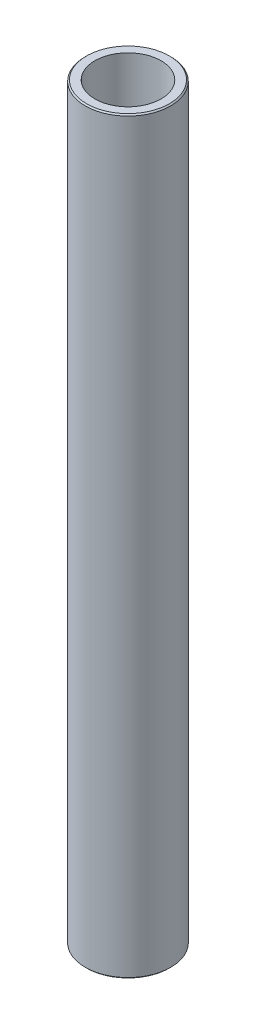
ISO-10303-21;
HEADER;
FILE_DESCRIPTION(('STEP AP214'),'2;1');
FILE_NAME('part.step','',(''),(''),'','','');
FILE_SCHEMA(('AUTOMOTIVE_DESIGN { 1 0 10303 214 1 1 1 1 }'));
ENDSEC;
DATA;
#1=APPLICATION_CONTEXT('core data for automotive mechanical design processes');
#2=APPLICATION_PROTOCOL_DEFINITION('international standard','automotive_design',2000,#1);
#3=PRODUCT_CONTEXT('',#1,'mechanical');
#4=PRODUCT('Part','Part','',(#3));
#5=PRODUCT_RELATED_PRODUCT_CATEGORY('part','',(#4));
#6=PRODUCT_DEFINITION_FORMATION('','',#4);
#7=PRODUCT_DEFINITION_CONTEXT('part definition',#1,'design');
#8=PRODUCT_DEFINITION('design','',#6,#7);
#9=PRODUCT_DEFINITION_SHAPE('','',#8);
#10=(LENGTH_UNIT() NAMED_UNIT(*) SI_UNIT(.MILLI.,.METRE.));
#11=(NAMED_UNIT(*) PLANE_ANGLE_UNIT() SI_UNIT($,.RADIAN.));
#12=(NAMED_UNIT(*) SI_UNIT($,.STERADIAN.) SOLID_ANGLE_UNIT());
#13=UNCERTAINTY_MEASURE_WITH_UNIT(LENGTH_MEASURE(1.E-05),#10,'distance_accuracy_value','');
#14=(GEOMETRIC_REPRESENTATION_CONTEXT(3) GLOBAL_UNCERTAINTY_ASSIGNED_CONTEXT((#13)) GLOBAL_UNIT_ASSIGNED_CONTEXT((#10,
#11,#12)) REPRESENTATION_CONTEXT('',''));
#15=CARTESIAN_POINT('',(0.,0.,0.));
#16=DIRECTION('',(0.,0.,1.));
#17=DIRECTION('',(1.,0.,0.));
#18=AXIS2_PLACEMENT_3D('',#15,#16,#17);
#19=CARTESIAN_POINT('',(0.,438.441485317942,0.));
#20=DIRECTION('',(0.,-1.,0.));
#21=DIRECTION('',(0.,0.,-1.));
#22=AXIS2_PLACEMENT_3D('',#19,#20,#21);
#23=CYLINDRICAL_SURFACE('',#22,25.);
#24=CARTESIAN_POINT('',(0.,437.706154205208,0.));
#25=DIRECTION('',(0.,1.,0.));
#26=DIRECTION('',(0.,0.,1.));
#27=AXIS2_PLACEMENT_3D('',#24,#25,#26);
#28=CIRCLE('',#27,25.);
#29=CARTESIAN_POINT('',(0.,437.706154205208,25.));
#30=VERTEX_POINT('',#29);
#31=EDGE_CURVE('E50',#30,#30,#28,.F.);
#32=ORIENTED_EDGE('',*,*,#31,.T.);
#33=EDGE_LOOP('',(#32));
#34=FACE_BOUND('',#33,.T.);
#35=CARTESIAN_POINT('',(0.,0.735331112733884,0.));
#36=DIRECTION('',(0.,1.,0.));
#37=DIRECTION('',(0.,0.,1.));
#38=AXIS2_PLACEMENT_3D('',#35,#36,#37);
#39=CIRCLE('',#38,25.);
#40=CARTESIAN_POINT('',(0.,0.735331112733884,25.));
#41=VERTEX_POINT('',#40);
#42=EDGE_CURVE('E51',#41,#41,#39,.T.);
#43=ORIENTED_EDGE('',*,*,#42,.T.);
#44=EDGE_LOOP('',(#43));
#45=FACE_BOUND('',#44,.T.);
#46=ADVANCED_FACE('F39',(#34,#45),#23,.T.);
#47=CARTESIAN_POINT('',(0.,438.441485317942,0.));
#48=DIRECTION('',(0.,1.,0.));
#49=DIRECTION('',(0.,0.,1.));
#50=AXIS2_PLACEMENT_3D('',#47,#48,#49);
#51=PLANE('',#50);
#52=CARTESIAN_POINT('',(0.,438.441485317942,0.));
#53=DIRECTION('',(0.,1.,0.));
#54=DIRECTION('',(0.,0.,1.));
#55=AXIS2_PLACEMENT_3D('',#52,#53,#54);
#56=CIRCLE('',#55,24.2646688872662);
#57=CARTESIAN_POINT('',(0.,438.441485317942,24.2646688872662));
#58=VERTEX_POINT('',#57);
#59=EDGE_CURVE('E54',#58,#58,#56,.T.);
#60=ORIENTED_EDGE('',*,*,#59,.T.);
#61=EDGE_LOOP('',(#60));
#62=FACE_BOUND('',#61,.T.);
#63=CARTESIAN_POINT('',(0.,438.441485317942,0.));
#64=DIRECTION('',(0.,1.,0.));
#65=DIRECTION('',(0.,0.,1.));
#66=AXIS2_PLACEMENT_3D('',#63,#64,#65);
#67=CIRCLE('',#66,19.3936435768947);
#68=CARTESIAN_POINT('',(0.,438.441485317942,19.3936435768947));
#69=VERTEX_POINT('',#68);
#70=EDGE_CURVE('E58',#69,#69,#67,.T.);
#71=ORIENTED_EDGE('',*,*,#70,.F.);
#72=EDGE_LOOP('',(#71));
#73=FACE_BOUND('',#72,.T.);
#74=ADVANCED_FACE('F69',(#62,#73),#51,.T.);
#75=CARTESIAN_POINT('',(0.,0.,0.));
#76=DIRECTION('',(0.,1.,0.));
#77=DIRECTION('',(0.,0.,1.));
#78=AXIS2_PLACEMENT_3D('',#75,#76,#77);
#79=PLANE('',#78);
#80=CARTESIAN_POINT('',(0.,0.,0.));
#81=DIRECTION('',(0.,1.,0.));
#82=DIRECTION('',(0.,0.,1.));
#83=AXIS2_PLACEMENT_3D('',#80,#81,#82);
#84=CIRCLE('',#83,24.2646688872661);
#85=CARTESIAN_POINT('',(0.,0.,24.2646688872661));
#86=VERTEX_POINT('',#85);
#87=EDGE_CURVE('E10',#86,#86,#84,.F.);
#88=ORIENTED_EDGE('',*,*,#87,.T.);
#89=EDGE_LOOP('',(#88));
#90=FACE_BOUND('',#89,.T.);
#91=CARTESIAN_POINT('',(0.,0.,0.));
#92=DIRECTION('',(0.,1.,0.));
#93=DIRECTION('',(0.,0.,1.));
#94=AXIS2_PLACEMENT_3D('',#91,#92,#93);
#95=CIRCLE('',#94,19.3936435768947);
#96=CARTESIAN_POINT('',(0.,0.,19.3936435768947));
#97=VERTEX_POINT('',#96);
#98=EDGE_CURVE('E63',#97,#97,#95,.T.);
#99=ORIENTED_EDGE('',*,*,#98,.T.);
#100=EDGE_LOOP('',(#99));
#101=FACE_BOUND('',#100,.T.);
#102=ADVANCED_FACE('F75',(#90,#101),#79,.F.);
#103=CARTESIAN_POINT('',(0.,438.441485317942,0.));
#104=DIRECTION('',(0.,-1.,0.));
#105=DIRECTION('',(0.,0.,-1.));
#106=AXIS2_PLACEMENT_3D('',#103,#104,#105);
#107=CYLINDRICAL_SURFACE('',#106,19.3936435768947);
#108=ORIENTED_EDGE('',*,*,#70,.T.);
#109=EDGE_LOOP('',(#108));
#110=FACE_BOUND('',#109,.T.);
#111=ORIENTED_EDGE('',*,*,#98,.F.);
#112=EDGE_LOOP('',(#111));
#113=FACE_BOUND('',#112,.T.);
#114=ADVANCED_FACE('F70',(#110,#113),#107,.F.);
#115=CARTESIAN_POINT('',(0.,438.441485317942,0.));
#116=DIRECTION('',(0.,-1.,0.));
#117=DIRECTION('',(0.,0.,-1.));
#118=AXIS2_PLACEMENT_3D('',#115,#116,#117);
#119=CONICAL_SURFACE('',#118,24.2646688872662,0.785398163397434);
#120=ORIENTED_EDGE('',*,*,#31,.F.);
#121=EDGE_LOOP('',(#120));
#122=FACE_BOUND('',#121,.T.);
#123=ORIENTED_EDGE('',*,*,#59,.F.);
#124=EDGE_LOOP('',(#123));
#125=FACE_BOUND('',#124,.T.);
#126=ADVANCED_FACE('F81',(#122,#125),#119,.T.);
#127=CARTESIAN_POINT('',(0.,0.735331112733884,0.));
#128=DIRECTION('',(0.,1.,0.));
#129=DIRECTION('',(0.,0.,1.));
#130=AXIS2_PLACEMENT_3D('',#127,#128,#129);
#131=CONICAL_SURFACE('',#130,25.,0.785398163397432);
#132=ORIENTED_EDGE('',*,*,#87,.F.);
#133=EDGE_LOOP('',(#132));
#134=FACE_BOUND('',#133,.T.);
#135=ORIENTED_EDGE('',*,*,#42,.F.);
#136=EDGE_LOOP('',(#135));
#137=FACE_BOUND('',#136,.T.);
#138=ADVANCED_FACE('F45',(#134,#137),#131,.T.);
#139=CLOSED_SHELL('',(#46,#74,#102,#114,#126,#138));
#140=MANIFOLD_SOLID_BREP('B2',#139);
#141=ADVANCED_BREP_SHAPE_REPRESENTATION('',(#18,#140),#14);
#142=SHAPE_DEFINITION_REPRESENTATION(#9,#141);
ENDSEC;
END-ISO-10303-21;
